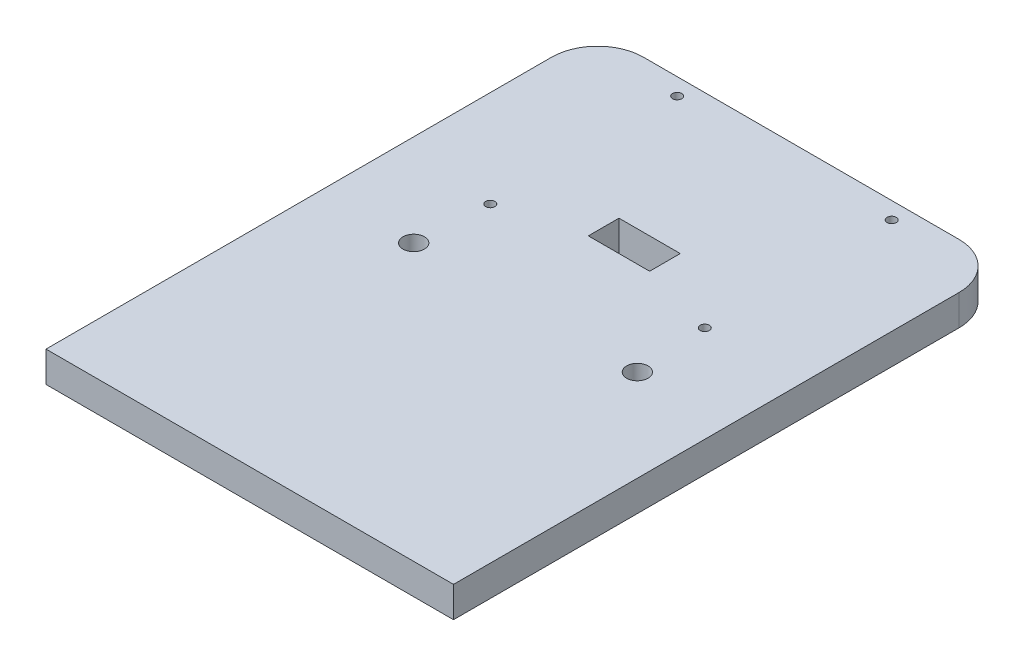
ISO-10303-21;
HEADER;
FILE_DESCRIPTION(('STEP AP214'),'2;1');
FILE_NAME('part.step','',(''),(''),'','','');
FILE_SCHEMA(('AUTOMOTIVE_DESIGN { 1 0 10303 214 1 1 1 1 }'));
ENDSEC;
DATA;
#1=APPLICATION_CONTEXT('core data for automotive mechanical design processes');
#2=APPLICATION_PROTOCOL_DEFINITION('international standard','automotive_design',2000,#1);
#3=PRODUCT_CONTEXT('',#1,'mechanical');
#4=PRODUCT('Part','Part','',(#3));
#5=PRODUCT_RELATED_PRODUCT_CATEGORY('part','',(#4));
#6=PRODUCT_DEFINITION_FORMATION('','',#4);
#7=PRODUCT_DEFINITION_CONTEXT('part definition',#1,'design');
#8=PRODUCT_DEFINITION('design','',#6,#7);
#9=PRODUCT_DEFINITION_SHAPE('','',#8);
#10=(LENGTH_UNIT() NAMED_UNIT(*) SI_UNIT(.MILLI.,.METRE.));
#11=(NAMED_UNIT(*) PLANE_ANGLE_UNIT() SI_UNIT($,.RADIAN.));
#12=(NAMED_UNIT(*) SI_UNIT($,.STERADIAN.) SOLID_ANGLE_UNIT());
#13=UNCERTAINTY_MEASURE_WITH_UNIT(LENGTH_MEASURE(1.E-05),#10,'distance_accuracy_value','');
#14=(GEOMETRIC_REPRESENTATION_CONTEXT(3) GLOBAL_UNCERTAINTY_ASSIGNED_CONTEXT((#13)) GLOBAL_UNIT_ASSIGNED_CONTEXT((#10,
#11,#12)) REPRESENTATION_CONTEXT('',''));
#15=CARTESIAN_POINT('',(0.,0.,0.));
#16=DIRECTION('',(0.,0.,1.));
#17=DIRECTION('',(1.,0.,0.));
#18=AXIS2_PLACEMENT_3D('',#15,#16,#17);
#19=CARTESIAN_POINT('',(0.,10.,-40.5));
#20=DIRECTION('',(0.,0.,-1.));
#21=DIRECTION('',(-1.,0.,0.));
#22=AXIS2_PLACEMENT_3D('',#19,#20,#21);
#23=PLANE('',#22);
#24=DIRECTION('',(1.,0.,0.));
#25=VECTOR('',#24,1.);
#26=CARTESIAN_POINT('',(0.,0.,-40.5));
#27=LINE('',#26,#25);
#28=CARTESIAN_POINT('',(-9.99999999999997,0.,-40.5));
#29=VERTEX_POINT('',#28);
#30=CARTESIAN_POINT('',(10.,0.,-40.5));
#31=VERTEX_POINT('',#30);
#32=EDGE_CURVE('E180',#29,#31,#27,.T.);
#33=ORIENTED_EDGE('',*,*,#32,.T.);
#34=DIRECTION('',(0.,-1.,0.));
#35=VECTOR('',#34,1.);
#36=CARTESIAN_POINT('',(10.,10.,-40.5));
#37=LINE('',#36,#35);
#38=CARTESIAN_POINT('',(10.,10.,-40.5));
#39=VERTEX_POINT('',#38);
#40=EDGE_CURVE('E11',#39,#31,#37,.T.);
#41=ORIENTED_EDGE('',*,*,#40,.F.);
#42=DIRECTION('',(1.,0.,0.));
#43=VECTOR('',#42,1.);
#44=CARTESIAN_POINT('',(0.,10.,-40.5));
#45=LINE('',#44,#43);
#46=CARTESIAN_POINT('',(-9.99999999999997,10.,-40.5));
#47=VERTEX_POINT('',#46);
#48=EDGE_CURVE('E128',#47,#39,#45,.T.);
#49=ORIENTED_EDGE('',*,*,#48,.F.);
#50=DIRECTION('',(0.,-1.,0.));
#51=VECTOR('',#50,1.);
#52=CARTESIAN_POINT('',(-9.99999999999997,10.,-40.5));
#53=LINE('',#52,#51);
#54=EDGE_CURVE('E53',#47,#29,#53,.T.);
#55=ORIENTED_EDGE('',*,*,#54,.T.);
#56=EDGE_LOOP('',(#33,#41,#49,#55));
#57=FACE_BOUND('',#56,.T.);
#58=ADVANCED_FACE('F34',(#57),#23,.F.);
#59=CARTESIAN_POINT('',(10.,10.,0.));
#60=DIRECTION('',(1.,0.,0.));
#61=DIRECTION('',(0.,0.,-1.));
#62=AXIS2_PLACEMENT_3D('',#59,#60,#61);
#63=PLANE('',#62);
#64=DIRECTION('',(0.,0.,1.));
#65=VECTOR('',#64,1.);
#66=CARTESIAN_POINT('',(10.,0.,0.));
#67=LINE('',#66,#65);
#68=CARTESIAN_POINT('',(10.,0.,-30.5));
#69=VERTEX_POINT('',#68);
#70=EDGE_CURVE('E134',#31,#69,#67,.T.);
#71=ORIENTED_EDGE('',*,*,#70,.T.);
#72=DIRECTION('',(0.,-1.,0.));
#73=VECTOR('',#72,1.);
#74=CARTESIAN_POINT('',(10.,10.,-30.5));
#75=LINE('',#74,#73);
#76=CARTESIAN_POINT('',(10.,10.,-30.5));
#77=VERTEX_POINT('',#76);
#78=EDGE_CURVE('E44',#77,#69,#75,.T.);
#79=ORIENTED_EDGE('',*,*,#78,.F.);
#80=DIRECTION('',(0.,0.,1.));
#81=VECTOR('',#80,1.);
#82=CARTESIAN_POINT('',(10.,10.,0.));
#83=LINE('',#82,#81);
#84=EDGE_CURVE('E121',#39,#77,#83,.T.);
#85=ORIENTED_EDGE('',*,*,#84,.F.);
#86=ORIENTED_EDGE('',*,*,#40,.T.);
#87=EDGE_LOOP('',(#71,#79,#85,#86));
#88=FACE_BOUND('',#87,.T.);
#89=ADVANCED_FACE('F133',(#88),#63,.F.);
#90=CARTESIAN_POINT('',(0.,10.,-30.5));
#91=DIRECTION('',(0.,0.,-1.));
#92=DIRECTION('',(-1.,0.,0.));
#93=AXIS2_PLACEMENT_3D('',#90,#91,#92);
#94=PLANE('',#93);
#95=DIRECTION('',(1.,0.,0.));
#96=VECTOR('',#95,1.);
#97=CARTESIAN_POINT('',(0.,0.,-30.5));
#98=LINE('',#97,#96);
#99=CARTESIAN_POINT('',(-9.99999999999997,0.,-30.5));
#100=VERTEX_POINT('',#99);
#101=EDGE_CURVE('E183',#100,#69,#98,.T.);
#102=ORIENTED_EDGE('',*,*,#101,.F.);
#103=DIRECTION('',(0.,-1.,0.));
#104=VECTOR('',#103,1.);
#105=CARTESIAN_POINT('',(-9.99999999999997,10.,-30.5));
#106=LINE('',#105,#104);
#107=CARTESIAN_POINT('',(-9.99999999999997,10.,-30.5));
#108=VERTEX_POINT('',#107);
#109=EDGE_CURVE('E85',#108,#100,#106,.T.);
#110=ORIENTED_EDGE('',*,*,#109,.F.);
#111=DIRECTION('',(1.,0.,0.));
#112=VECTOR('',#111,1.);
#113=CARTESIAN_POINT('',(0.,10.,-30.5));
#114=LINE('',#113,#112);
#115=EDGE_CURVE('E127',#108,#77,#114,.T.);
#116=ORIENTED_EDGE('',*,*,#115,.T.);
#117=ORIENTED_EDGE('',*,*,#78,.T.);
#118=EDGE_LOOP('',(#102,#110,#116,#117));
#119=FACE_BOUND('',#118,.T.);
#120=ADVANCED_FACE('F138',(#119),#94,.T.);
#121=CARTESIAN_POINT('',(51.5,10.,-75.));
#122=DIRECTION('',(0.,-1.,0.));
#123=DIRECTION('',(0.,0.,-1.));
#124=AXIS2_PLACEMENT_3D('',#121,#122,#123);
#125=CYLINDRICAL_SURFACE('',#124,15.);
#126=CARTESIAN_POINT('',(51.5,0.,-75.));
#127=DIRECTION('',(0.,1.,0.));
#128=DIRECTION('',(0.,0.,1.));
#129=AXIS2_PLACEMENT_3D('',#126,#127,#128);
#130=CIRCLE('',#129,15.);
#131=CARTESIAN_POINT('',(66.5,0.,-75.));
#132=VERTEX_POINT('',#131);
#133=CARTESIAN_POINT('',(51.5,0.,-90.));
#134=VERTEX_POINT('',#133);
#135=EDGE_CURVE('E151',#132,#134,#130,.T.);
#136=ORIENTED_EDGE('',*,*,#135,.T.);
#137=DIRECTION('',(0.,-1.,0.));
#138=VECTOR('',#137,1.);
#139=CARTESIAN_POINT('',(51.5,10.,-90.));
#140=LINE('',#139,#138);
#141=CARTESIAN_POINT('',(51.5,10.,-90.));
#142=VERTEX_POINT('',#141);
#143=EDGE_CURVE('E38',#142,#134,#140,.T.);
#144=ORIENTED_EDGE('',*,*,#143,.F.);
#145=CARTESIAN_POINT('',(51.5,10.,-75.));
#146=DIRECTION('',(0.,1.,0.));
#147=DIRECTION('',(0.,0.,1.));
#148=AXIS2_PLACEMENT_3D('',#145,#146,#147);
#149=CIRCLE('',#148,15.);
#150=CARTESIAN_POINT('',(66.5,10.,-75.));
#151=VERTEX_POINT('',#150);
#152=EDGE_CURVE('E98',#151,#142,#149,.T.);
#153=ORIENTED_EDGE('',*,*,#152,.F.);
#154=DIRECTION('',(0.,-1.,0.));
#155=VECTOR('',#154,1.);
#156=CARTESIAN_POINT('',(66.5,10.,-75.));
#157=LINE('',#156,#155);
#158=EDGE_CURVE('E150',#151,#132,#157,.T.);
#159=ORIENTED_EDGE('',*,*,#158,.T.);
#160=EDGE_LOOP('',(#136,#144,#153,#159));
#161=FACE_BOUND('',#160,.T.);
#162=ADVANCED_FACE('F36',(#161),#125,.T.);
#163=CARTESIAN_POINT('',(0.,10.,-90.));
#164=DIRECTION('',(0.,0.,-1.));
#165=DIRECTION('',(-1.,0.,0.));
#166=AXIS2_PLACEMENT_3D('',#163,#164,#165);
#167=PLANE('',#166);
#168=DIRECTION('',(1.,0.,0.));
#169=VECTOR('',#168,1.);
#170=CARTESIAN_POINT('',(0.,0.,-90.));
#171=LINE('',#170,#169);
#172=CARTESIAN_POINT('',(-51.5,0.,-90.));
#173=VERTEX_POINT('',#172);
#174=EDGE_CURVE('E154',#173,#134,#171,.T.);
#175=ORIENTED_EDGE('',*,*,#174,.F.);
#176=DIRECTION('',(0.,-1.,0.));
#177=VECTOR('',#176,1.);
#178=CARTESIAN_POINT('',(-51.5,10.,-90.));
#179=LINE('',#178,#177);
#180=CARTESIAN_POINT('',(-51.5,10.,-90.));
#181=VERTEX_POINT('',#180);
#182=EDGE_CURVE('E203',#181,#173,#179,.T.);
#183=ORIENTED_EDGE('',*,*,#182,.F.);
#184=DIRECTION('',(1.,0.,0.));
#185=VECTOR('',#184,1.);
#186=CARTESIAN_POINT('',(0.,10.,-90.));
#187=LINE('',#186,#185);
#188=EDGE_CURVE('E211',#181,#142,#187,.T.);
#189=ORIENTED_EDGE('',*,*,#188,.T.);
#190=ORIENTED_EDGE('',*,*,#143,.T.);
#191=EDGE_LOOP('',(#175,#183,#189,#190));
#192=FACE_BOUND('',#191,.T.);
#193=ADVANCED_FACE('F210',(#192),#167,.T.);
#194=CARTESIAN_POINT('',(-51.5,10.,-75.));
#195=DIRECTION('',(0.,-1.,0.));
#196=DIRECTION('',(0.,0.,-1.));
#197=AXIS2_PLACEMENT_3D('',#194,#195,#196);
#198=CYLINDRICAL_SURFACE('',#197,15.);
#199=CARTESIAN_POINT('',(-51.5,0.,-75.));
#200=DIRECTION('',(0.,1.,0.));
#201=DIRECTION('',(0.,0.,1.));
#202=AXIS2_PLACEMENT_3D('',#199,#200,#201);
#203=CIRCLE('',#202,15.);
#204=CARTESIAN_POINT('',(-66.5,0.,-75.));
#205=VERTEX_POINT('',#204);
#206=EDGE_CURVE('E157',#205,#173,#203,.F.);
#207=ORIENTED_EDGE('',*,*,#206,.F.);
#208=DIRECTION('',(0.,-1.,0.));
#209=VECTOR('',#208,1.);
#210=CARTESIAN_POINT('',(-66.5,10.,-75.));
#211=LINE('',#210,#209);
#212=CARTESIAN_POINT('',(-66.5,10.,-75.));
#213=VERTEX_POINT('',#212);
#214=EDGE_CURVE('E202',#213,#205,#211,.T.);
#215=ORIENTED_EDGE('',*,*,#214,.F.);
#216=CARTESIAN_POINT('',(-51.5,10.,-75.));
#217=DIRECTION('',(0.,1.,0.));
#218=DIRECTION('',(0.,0.,1.));
#219=AXIS2_PLACEMENT_3D('',#216,#217,#218);
#220=CIRCLE('',#219,15.);
#221=EDGE_CURVE('E223',#213,#181,#220,.F.);
#222=ORIENTED_EDGE('',*,*,#221,.T.);
#223=ORIENTED_EDGE('',*,*,#182,.T.);
#224=EDGE_LOOP('',(#207,#215,#222,#223));
#225=FACE_BOUND('',#224,.T.);
#226=ADVANCED_FACE('F220',(#225),#198,.T.);
#227=CARTESIAN_POINT('',(-66.5,10.,0.));
#228=DIRECTION('',(1.,0.,0.));
#229=DIRECTION('',(0.,0.,-1.));
#230=AXIS2_PLACEMENT_3D('',#227,#228,#229);
#231=PLANE('',#230);
#232=DIRECTION('',(0.,0.,1.));
#233=VECTOR('',#232,1.);
#234=CARTESIAN_POINT('',(-66.5,0.,0.));
#235=LINE('',#234,#233);
#236=CARTESIAN_POINT('',(-66.5,0.,90.));
#237=VERTEX_POINT('',#236);
#238=EDGE_CURVE('E160',#205,#237,#235,.T.);
#239=ORIENTED_EDGE('',*,*,#238,.T.);
#240=DIRECTION('',(0.,-1.,0.));
#241=VECTOR('',#240,1.);
#242=CARTESIAN_POINT('',(-66.5,10.,90.));
#243=LINE('',#242,#241);
#244=CARTESIAN_POINT('',(-66.5,10.,90.));
#245=VERTEX_POINT('',#244);
#246=EDGE_CURVE('E199',#245,#237,#243,.T.);
#247=ORIENTED_EDGE('',*,*,#246,.F.);
#248=DIRECTION('',(0.,0.,1.));
#249=VECTOR('',#248,1.);
#250=CARTESIAN_POINT('',(-66.5,10.,0.));
#251=LINE('',#250,#249);
#252=EDGE_CURVE('E226',#213,#245,#251,.T.);
#253=ORIENTED_EDGE('',*,*,#252,.F.);
#254=ORIENTED_EDGE('',*,*,#214,.T.);
#255=EDGE_LOOP('',(#239,#247,#253,#254));
#256=FACE_BOUND('',#255,.T.);
#257=ADVANCED_FACE('F227',(#256),#231,.F.);
#258=CARTESIAN_POINT('',(0.,10.,90.));
#259=DIRECTION('',(0.,0.,-1.));
#260=DIRECTION('',(-1.,0.,0.));
#261=AXIS2_PLACEMENT_3D('',#258,#259,#260);
#262=PLANE('',#261);
#263=DIRECTION('',(1.,0.,0.));
#264=VECTOR('',#263,1.);
#265=CARTESIAN_POINT('',(0.,0.,90.));
#266=LINE('',#265,#264);
#267=CARTESIAN_POINT('',(66.5,0.,90.));
#268=VERTEX_POINT('',#267);
#269=EDGE_CURVE('E162',#237,#268,#266,.T.);
#270=ORIENTED_EDGE('',*,*,#269,.T.);
#271=DIRECTION('',(0.,-1.,0.));
#272=VECTOR('',#271,1.);
#273=CARTESIAN_POINT('',(66.5,10.,90.));
#274=LINE('',#273,#272);
#275=CARTESIAN_POINT('',(66.5,10.,90.));
#276=VERTEX_POINT('',#275);
#277=EDGE_CURVE('E197',#276,#268,#274,.T.);
#278=ORIENTED_EDGE('',*,*,#277,.F.);
#279=DIRECTION('',(1.,0.,0.));
#280=VECTOR('',#279,1.);
#281=CARTESIAN_POINT('',(0.,10.,90.));
#282=LINE('',#281,#280);
#283=EDGE_CURVE('E229',#245,#276,#282,.T.);
#284=ORIENTED_EDGE('',*,*,#283,.F.);
#285=ORIENTED_EDGE('',*,*,#246,.T.);
#286=EDGE_LOOP('',(#270,#278,#284,#285));
#287=FACE_BOUND('',#286,.T.);
#288=ADVANCED_FACE('F293',(#287),#262,.F.);
#289=CARTESIAN_POINT('',(-35.,10.,-84.5));
#290=DIRECTION('',(0.,-1.,0.));
#291=DIRECTION('',(0.,0.,-1.));
#292=AXIS2_PLACEMENT_3D('',#289,#290,#291);
#293=CYLINDRICAL_SURFACE('',#292,1.5);
#294=CARTESIAN_POINT('',(-35.,10.,-84.5));
#295=DIRECTION('',(0.,1.,0.));
#296=DIRECTION('',(0.,0.,1.));
#297=AXIS2_PLACEMENT_3D('',#294,#295,#296);
#298=CIRCLE('',#297,1.5);
#299=CARTESIAN_POINT('',(-35.,10.,-83.));
#300=VERTEX_POINT('',#299);
#301=EDGE_CURVE('E141',#300,#300,#298,.T.);
#302=ORIENTED_EDGE('',*,*,#301,.T.);
#303=EDGE_LOOP('',(#302));
#304=FACE_BOUND('',#303,.T.);
#305=CARTESIAN_POINT('',(-35.,0.,-84.5));
#306=DIRECTION('',(0.,1.,0.));
#307=DIRECTION('',(0.,0.,1.));
#308=AXIS2_PLACEMENT_3D('',#305,#306,#307);
#309=CIRCLE('',#308,1.5);
#310=CARTESIAN_POINT('',(-35.,0.,-83.));
#311=VERTEX_POINT('',#310);
#312=EDGE_CURVE('E188',#311,#311,#309,.T.);
#313=ORIENTED_EDGE('',*,*,#312,.F.);
#314=EDGE_LOOP('',(#313));
#315=FACE_BOUND('',#314,.T.);
#316=ADVANCED_FACE('F296',(#304,#315),#293,.F.);
#317=CARTESIAN_POINT('',(-9.99999999999996,10.,0.));
#318=DIRECTION('',(1.,0.,0.));
#319=DIRECTION('',(0.,0.,-1.));
#320=AXIS2_PLACEMENT_3D('',#317,#318,#319);
#321=PLANE('',#320);
#322=DIRECTION('',(0.,0.,1.));
#323=VECTOR('',#322,1.);
#324=CARTESIAN_POINT('',(-9.99999999999996,0.,0.));
#325=LINE('',#324,#323);
#326=EDGE_CURVE('E185',#29,#100,#325,.T.);
#327=ORIENTED_EDGE('',*,*,#326,.F.);
#328=ORIENTED_EDGE('',*,*,#54,.F.);
#329=DIRECTION('',(0.,0.,1.));
#330=VECTOR('',#329,1.);
#331=CARTESIAN_POINT('',(-9.99999999999996,10.,0.));
#332=LINE('',#331,#330);
#333=EDGE_CURVE('E139',#47,#108,#332,.T.);
#334=ORIENTED_EDGE('',*,*,#333,.T.);
#335=ORIENTED_EDGE('',*,*,#109,.T.);
#336=EDGE_LOOP('',(#327,#328,#334,#335));
#337=FACE_BOUND('',#336,.T.);
#338=ADVANCED_FACE('F278',(#337),#321,.T.);
#339=CARTESIAN_POINT('',(36.5,10.,0.));
#340=DIRECTION('',(0.,-1.,0.));
#341=DIRECTION('',(0.,0.,-1.));
#342=AXIS2_PLACEMENT_3D('',#339,#340,#341);
#343=CYLINDRICAL_SURFACE('',#342,3.5);
#344=CARTESIAN_POINT('',(36.5,10.,0.));
#345=DIRECTION('',(0.,1.,0.));
#346=DIRECTION('',(0.,0.,1.));
#347=AXIS2_PLACEMENT_3D('',#344,#345,#346);
#348=CIRCLE('',#347,3.5);
#349=CARTESIAN_POINT('',(36.5,10.,3.5));
#350=VERTEX_POINT('',#349);
#351=EDGE_CURVE('E249',#350,#350,#348,.T.);
#352=ORIENTED_EDGE('',*,*,#351,.T.);
#353=EDGE_LOOP('',(#352));
#354=FACE_BOUND('',#353,.T.);
#355=CARTESIAN_POINT('',(36.5,0.,0.));
#356=DIRECTION('',(0.,1.,0.));
#357=DIRECTION('',(0.,0.,1.));
#358=AXIS2_PLACEMENT_3D('',#355,#356,#357);
#359=CIRCLE('',#358,3.5);
#360=CARTESIAN_POINT('',(36.5,0.,3.5));
#361=VERTEX_POINT('',#360);
#362=EDGE_CURVE('E177',#361,#361,#359,.T.);
#363=ORIENTED_EDGE('',*,*,#362,.F.);
#364=EDGE_LOOP('',(#363));
#365=FACE_BOUND('',#364,.T.);
#366=ADVANCED_FACE('F253',(#354,#365),#343,.F.);
#367=CARTESIAN_POINT('',(35.,10.,-23.5));
#368=DIRECTION('',(0.,-1.,0.));
#369=DIRECTION('',(0.,0.,-1.));
#370=AXIS2_PLACEMENT_3D('',#367,#368,#369);
#371=CYLINDRICAL_SURFACE('',#370,1.5);
#372=CARTESIAN_POINT('',(35.,10.,-23.5));
#373=DIRECTION('',(0.,1.,0.));
#374=DIRECTION('',(0.,0.,1.));
#375=AXIS2_PLACEMENT_3D('',#372,#373,#374);
#376=CIRCLE('',#375,1.5);
#377=CARTESIAN_POINT('',(35.,10.,-22.));
#378=VERTEX_POINT('',#377);
#379=EDGE_CURVE('E246',#378,#378,#376,.T.);
#380=ORIENTED_EDGE('',*,*,#379,.T.);
#381=EDGE_LOOP('',(#380));
#382=FACE_BOUND('',#381,.T.);
#383=CARTESIAN_POINT('',(35.,0.,-23.5));
#384=DIRECTION('',(0.,1.,0.));
#385=DIRECTION('',(0.,0.,1.));
#386=AXIS2_PLACEMENT_3D('',#383,#384,#385);
#387=CIRCLE('',#386,1.5);
#388=CARTESIAN_POINT('',(35.,0.,-22.));
#389=VERTEX_POINT('',#388);
#390=EDGE_CURVE('E174',#389,#389,#387,.T.);
#391=ORIENTED_EDGE('',*,*,#390,.F.);
#392=EDGE_LOOP('',(#391));
#393=FACE_BOUND('',#392,.T.);
#394=ADVANCED_FACE('F277',(#382,#393),#371,.F.);
#395=CARTESIAN_POINT('',(-36.5,10.,0.));
#396=DIRECTION('',(0.,-1.,0.));
#397=DIRECTION('',(0.,0.,-1.));
#398=AXIS2_PLACEMENT_3D('',#395,#396,#397);
#399=CYLINDRICAL_SURFACE('',#398,3.5);
#400=CARTESIAN_POINT('',(-36.5,10.,0.));
#401=DIRECTION('',(0.,1.,0.));
#402=DIRECTION('',(0.,0.,1.));
#403=AXIS2_PLACEMENT_3D('',#400,#401,#402);
#404=CIRCLE('',#403,3.5);
#405=CARTESIAN_POINT('',(-36.5,10.,3.5));
#406=VERTEX_POINT('',#405);
#407=EDGE_CURVE('E243',#406,#406,#404,.F.);
#408=ORIENTED_EDGE('',*,*,#407,.F.);
#409=EDGE_LOOP('',(#408));
#410=FACE_BOUND('',#409,.T.);
#411=CARTESIAN_POINT('',(-36.5,0.,0.));
#412=DIRECTION('',(0.,1.,0.));
#413=DIRECTION('',(0.,0.,1.));
#414=AXIS2_PLACEMENT_3D('',#411,#412,#413);
#415=CIRCLE('',#414,3.5);
#416=CARTESIAN_POINT('',(-36.5,0.,3.5));
#417=VERTEX_POINT('',#416);
#418=EDGE_CURVE('E171',#417,#417,#415,.F.);
#419=ORIENTED_EDGE('',*,*,#418,.T.);
#420=EDGE_LOOP('',(#419));
#421=FACE_BOUND('',#420,.T.);
#422=ADVANCED_FACE('F281',(#410,#421),#399,.F.);
#423=CARTESIAN_POINT('',(-35.,10.,-23.5));
#424=DIRECTION('',(0.,-1.,0.));
#425=DIRECTION('',(0.,0.,-1.));
#426=AXIS2_PLACEMENT_3D('',#423,#424,#425);
#427=CYLINDRICAL_SURFACE('',#426,1.5);
#428=CARTESIAN_POINT('',(-35.,10.,-23.5));
#429=DIRECTION('',(0.,1.,0.));
#430=DIRECTION('',(0.,0.,1.));
#431=AXIS2_PLACEMENT_3D('',#428,#429,#430);
#432=CIRCLE('',#431,1.5);
#433=CARTESIAN_POINT('',(-35.,10.,-22.));
#434=VERTEX_POINT('',#433);
#435=EDGE_CURVE('E240',#434,#434,#432,.F.);
#436=ORIENTED_EDGE('',*,*,#435,.F.);
#437=EDGE_LOOP('',(#436));
#438=FACE_BOUND('',#437,.T.);
#439=CARTESIAN_POINT('',(-35.,0.,-23.5));
#440=DIRECTION('',(0.,1.,0.));
#441=DIRECTION('',(0.,0.,1.));
#442=AXIS2_PLACEMENT_3D('',#439,#440,#441);
#443=CIRCLE('',#442,1.5);
#444=CARTESIAN_POINT('',(-35.,0.,-22.));
#445=VERTEX_POINT('',#444);
#446=EDGE_CURVE('E168',#445,#445,#443,.F.);
#447=ORIENTED_EDGE('',*,*,#446,.T.);
#448=EDGE_LOOP('',(#447));
#449=FACE_BOUND('',#448,.T.);
#450=ADVANCED_FACE('F285',(#438,#449),#427,.F.);
#451=CARTESIAN_POINT('',(66.5,10.,0.));
#452=DIRECTION('',(1.,0.,0.));
#453=DIRECTION('',(0.,0.,-1.));
#454=AXIS2_PLACEMENT_3D('',#451,#452,#453);
#455=PLANE('',#454);
#456=DIRECTION('',(0.,0.,1.));
#457=VECTOR('',#456,1.);
#458=CARTESIAN_POINT('',(66.5,0.,0.));
#459=LINE('',#458,#457);
#460=EDGE_CURVE('E165',#132,#268,#459,.T.);
#461=ORIENTED_EDGE('',*,*,#460,.F.);
#462=ORIENTED_EDGE('',*,*,#158,.F.);
#463=DIRECTION('',(0.,0.,1.));
#464=VECTOR('',#463,1.);
#465=CARTESIAN_POINT('',(66.5,10.,0.));
#466=LINE('',#465,#464);
#467=EDGE_CURVE('E237',#151,#276,#466,.T.);
#468=ORIENTED_EDGE('',*,*,#467,.T.);
#469=ORIENTED_EDGE('',*,*,#277,.T.);
#470=EDGE_LOOP('',(#461,#462,#468,#469));
#471=FACE_BOUND('',#470,.T.);
#472=ADVANCED_FACE('F264',(#471),#455,.T.);
#473=CARTESIAN_POINT('',(35.,10.,-84.5));
#474=DIRECTION('',(0.,-1.,0.));
#475=DIRECTION('',(0.,0.,-1.));
#476=AXIS2_PLACEMENT_3D('',#473,#474,#475);
#477=CYLINDRICAL_SURFACE('',#476,1.5);
#478=CARTESIAN_POINT('',(35.,10.,-84.5));
#479=DIRECTION('',(0.,1.,0.));
#480=DIRECTION('',(0.,0.,1.));
#481=AXIS2_PLACEMENT_3D('',#478,#479,#480);
#482=CIRCLE('',#481,1.5);
#483=CARTESIAN_POINT('',(35.,10.,-83.));
#484=VERTEX_POINT('',#483);
#485=EDGE_CURVE('E147',#484,#484,#482,.F.);
#486=ORIENTED_EDGE('',*,*,#485,.F.);
#487=EDGE_LOOP('',(#486));
#488=FACE_BOUND('',#487,.T.);
#489=CARTESIAN_POINT('',(35.,0.,-84.5));
#490=DIRECTION('',(0.,1.,0.));
#491=DIRECTION('',(0.,0.,1.));
#492=AXIS2_PLACEMENT_3D('',#489,#490,#491);
#493=CIRCLE('',#492,1.5);
#494=CARTESIAN_POINT('',(35.,0.,-83.));
#495=VERTEX_POINT('',#494);
#496=EDGE_CURVE('E191',#495,#495,#493,.F.);
#497=ORIENTED_EDGE('',*,*,#496,.T.);
#498=EDGE_LOOP('',(#497));
#499=FACE_BOUND('',#498,.T.);
#500=ADVANCED_FACE('F257',(#488,#499),#477,.F.);
#501=CARTESIAN_POINT('',(0.,10.,0.));
#502=DIRECTION('',(0.,1.,0.));
#503=DIRECTION('',(0.,0.,1.));
#504=AXIS2_PLACEMENT_3D('',#501,#502,#503);
#505=PLANE('',#504);
#506=ORIENTED_EDGE('',*,*,#152,.T.);
#507=ORIENTED_EDGE('',*,*,#188,.F.);
#508=ORIENTED_EDGE('',*,*,#221,.F.);
#509=ORIENTED_EDGE('',*,*,#252,.T.);
#510=ORIENTED_EDGE('',*,*,#283,.T.);
#511=ORIENTED_EDGE('',*,*,#467,.F.);
#512=EDGE_LOOP('',(#506,#507,#508,#509,#510,#511));
#513=FACE_BOUND('',#512,.T.);
#514=ORIENTED_EDGE('',*,*,#435,.T.);
#515=EDGE_LOOP('',(#514));
#516=FACE_BOUND('',#515,.T.);
#517=ORIENTED_EDGE('',*,*,#407,.T.);
#518=EDGE_LOOP('',(#517));
#519=FACE_BOUND('',#518,.T.);
#520=ORIENTED_EDGE('',*,*,#379,.F.);
#521=EDGE_LOOP('',(#520));
#522=FACE_BOUND('',#521,.T.);
#523=ORIENTED_EDGE('',*,*,#351,.F.);
#524=EDGE_LOOP('',(#523));
#525=FACE_BOUND('',#524,.T.);
#526=ORIENTED_EDGE('',*,*,#48,.T.);
#527=ORIENTED_EDGE('',*,*,#84,.T.);
#528=ORIENTED_EDGE('',*,*,#115,.F.);
#529=ORIENTED_EDGE('',*,*,#333,.F.);
#530=EDGE_LOOP('',(#526,#527,#528,#529));
#531=FACE_BOUND('',#530,.T.);
#532=ORIENTED_EDGE('',*,*,#301,.F.);
#533=EDGE_LOOP('',(#532));
#534=FACE_BOUND('',#533,.T.);
#535=ORIENTED_EDGE('',*,*,#485,.T.);
#536=EDGE_LOOP('',(#535));
#537=FACE_BOUND('',#536,.T.);
#538=ADVANCED_FACE('F123',(#513,#516,#519,#522,#525,#531,#534,#537),#505,.T.);
#539=CARTESIAN_POINT('',(0.,0.,0.));
#540=DIRECTION('',(0.,1.,0.));
#541=DIRECTION('',(0.,0.,1.));
#542=AXIS2_PLACEMENT_3D('',#539,#540,#541);
#543=PLANE('',#542);
#544=ORIENTED_EDGE('',*,*,#135,.F.);
#545=ORIENTED_EDGE('',*,*,#460,.T.);
#546=ORIENTED_EDGE('',*,*,#269,.F.);
#547=ORIENTED_EDGE('',*,*,#238,.F.);
#548=ORIENTED_EDGE('',*,*,#206,.T.);
#549=ORIENTED_EDGE('',*,*,#174,.T.);
#550=EDGE_LOOP('',(#544,#545,#546,#547,#548,#549));
#551=FACE_BOUND('',#550,.T.);
#552=ORIENTED_EDGE('',*,*,#446,.F.);
#553=EDGE_LOOP('',(#552));
#554=FACE_BOUND('',#553,.T.);
#555=ORIENTED_EDGE('',*,*,#418,.F.);
#556=EDGE_LOOP('',(#555));
#557=FACE_BOUND('',#556,.T.);
#558=ORIENTED_EDGE('',*,*,#390,.T.);
#559=EDGE_LOOP('',(#558));
#560=FACE_BOUND('',#559,.T.);
#561=ORIENTED_EDGE('',*,*,#362,.T.);
#562=EDGE_LOOP('',(#561));
#563=FACE_BOUND('',#562,.T.);
#564=ORIENTED_EDGE('',*,*,#32,.F.);
#565=ORIENTED_EDGE('',*,*,#326,.T.);
#566=ORIENTED_EDGE('',*,*,#101,.T.);
#567=ORIENTED_EDGE('',*,*,#70,.F.);
#568=EDGE_LOOP('',(#564,#565,#566,#567));
#569=FACE_BOUND('',#568,.T.);
#570=ORIENTED_EDGE('',*,*,#312,.T.);
#571=EDGE_LOOP('',(#570));
#572=FACE_BOUND('',#571,.T.);
#573=ORIENTED_EDGE('',*,*,#496,.F.);
#574=EDGE_LOOP('',(#573));
#575=FACE_BOUND('',#574,.T.);
#576=ADVANCED_FACE('F216',(#551,#554,#557,#560,#563,#569,#572,#575),#543,.F.);
#577=CLOSED_SHELL('',(#58,#89,#120,#162,#193,#226,#257,#288,#316,#338,#366,#394,#422,#450,#472,
#500,#538,#576));
#578=MANIFOLD_SOLID_BREP('B2',#577);
#579=ADVANCED_BREP_SHAPE_REPRESENTATION('',(#18,#578),#14);
#580=SHAPE_DEFINITION_REPRESENTATION(#9,#579);
ENDSEC;
END-ISO-10303-21;
